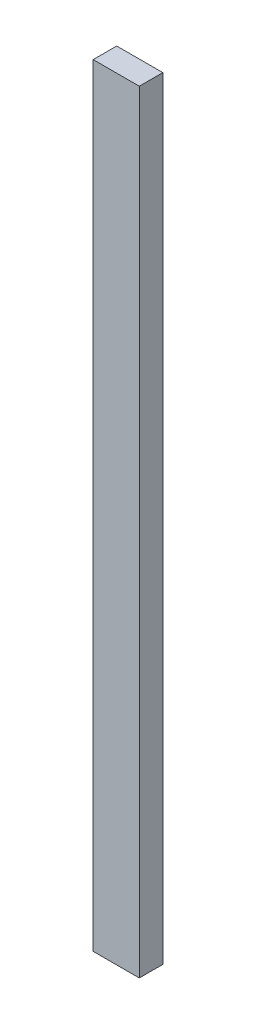
ISO-10303-21;
HEADER;
FILE_DESCRIPTION(('STEP AP214'),'2;1');
FILE_NAME('part.step','',(''),(''),'','','');
FILE_SCHEMA(('AUTOMOTIVE_DESIGN { 1 0 10303 214 1 1 1 1 }'));
ENDSEC;
DATA;
#1=APPLICATION_CONTEXT('core data for automotive mechanical design processes');
#2=APPLICATION_PROTOCOL_DEFINITION('international standard','automotive_design',2000,#1);
#3=PRODUCT_CONTEXT('',#1,'mechanical');
#4=PRODUCT('Part','Part','',(#3));
#5=PRODUCT_RELATED_PRODUCT_CATEGORY('part','',(#4));
#6=PRODUCT_DEFINITION_FORMATION('','',#4);
#7=PRODUCT_DEFINITION_CONTEXT('part definition',#1,'design');
#8=PRODUCT_DEFINITION('design','',#6,#7);
#9=PRODUCT_DEFINITION_SHAPE('','',#8);
#10=(LENGTH_UNIT() NAMED_UNIT(*) SI_UNIT(.MILLI.,.METRE.));
#11=(NAMED_UNIT(*) PLANE_ANGLE_UNIT() SI_UNIT($,.RADIAN.));
#12=(NAMED_UNIT(*) SI_UNIT($,.STERADIAN.) SOLID_ANGLE_UNIT());
#13=UNCERTAINTY_MEASURE_WITH_UNIT(LENGTH_MEASURE(1.E-05),#10,'distance_accuracy_value','');
#14=(GEOMETRIC_REPRESENTATION_CONTEXT(3) GLOBAL_UNCERTAINTY_ASSIGNED_CONTEXT((#13)) GLOBAL_UNIT_ASSIGNED_CONTEXT((#10,
#11,#12)) REPRESENTATION_CONTEXT('',''));
#15=CARTESIAN_POINT('',(0.,0.,0.));
#16=DIRECTION('',(0.,0.,1.));
#17=DIRECTION('',(1.,0.,0.));
#18=AXIS2_PLACEMENT_3D('',#15,#16,#17);
#19=CARTESIAN_POINT('',(-10.27,20.47,328.78));
#20=DIRECTION('',(0.,1.,0.));
#21=DIRECTION('',(0.,0.,1.));
#22=AXIS2_PLACEMENT_3D('',#19,#20,#21);
#23=PLANE('',#22);
#24=DIRECTION('',(1.,0.,0.));
#25=VECTOR('',#24,1.);
#26=CARTESIAN_POINT('',(301.625,20.47,-31.7500000000001));
#27=LINE('',#26,#25);
#28=CARTESIAN_POINT('',(261.525,20.47,-31.7500000000001));
#29=VERTEX_POINT('',#28);
#30=CARTESIAN_POINT('',(301.625,20.47,-31.7500000000001));
#31=VERTEX_POINT('',#30);
#32=EDGE_CURVE('E11',#29,#31,#27,.T.);
#33=ORIENTED_EDGE('',*,*,#32,.F.);
#34=DIRECTION('',(0.,0.,-1.));
#35=VECTOR('',#34,1.);
#36=CARTESIAN_POINT('',(261.525,20.47,-328.78));
#37=LINE('',#36,#35);
#38=CARTESIAN_POINT('',(261.525,20.47,-52.2200000000001));
#39=VERTEX_POINT('',#38);
#40=EDGE_CURVE('E37',#29,#39,#37,.T.);
#41=ORIENTED_EDGE('',*,*,#40,.T.);
#42=DIRECTION('',(-1.,0.,0.));
#43=VECTOR('',#42,1.);
#44=CARTESIAN_POINT('',(301.625,20.47,-52.22));
#45=LINE('',#44,#43);
#46=CARTESIAN_POINT('',(301.625,20.47,-52.22));
#47=VERTEX_POINT('',#46);
#48=EDGE_CURVE('E43',#47,#39,#45,.T.);
#49=ORIENTED_EDGE('',*,*,#48,.F.);
#50=DIRECTION('',(0.,0.,-1.));
#51=VECTOR('',#50,1.);
#52=CARTESIAN_POINT('',(301.625,20.47,349.25));
#53=LINE('',#52,#51);
#54=EDGE_CURVE('E77',#31,#47,#53,.T.);
#55=ORIENTED_EDGE('',*,*,#54,.F.);
#56=EDGE_LOOP('',(#33,#41,#49,#55));
#57=FACE_BOUND('',#56,.T.);
#58=ADVANCED_FACE('F34',(#57),#23,.F.);
#59=CARTESIAN_POINT('',(301.625,20.47,349.25));
#60=DIRECTION('',(-1.,0.,0.));
#61=DIRECTION('',(0.,0.,1.));
#62=AXIS2_PLACEMENT_3D('',#59,#60,#61);
#63=PLANE('',#62);
#64=DIRECTION('',(0.,-1.,0.));
#65=VECTOR('',#64,1.);
#66=CARTESIAN_POINT('',(301.625,692.15,-31.7500000000001));
#67=LINE('',#66,#65);
#68=CARTESIAN_POINT('',(301.625,692.15,-31.7500000000001));
#69=VERTEX_POINT('',#68);
#70=EDGE_CURVE('E97',#69,#31,#67,.T.);
#71=ORIENTED_EDGE('',*,*,#70,.T.);
#72=ORIENTED_EDGE('',*,*,#54,.T.);
#73=DIRECTION('',(0.,-1.,0.));
#74=VECTOR('',#73,1.);
#75=CARTESIAN_POINT('',(301.625,692.15,-52.22));
#76=LINE('',#75,#74);
#77=CARTESIAN_POINT('',(301.625,692.15,-52.22));
#78=VERTEX_POINT('',#77);
#79=EDGE_CURVE('E88',#78,#47,#76,.T.);
#80=ORIENTED_EDGE('',*,*,#79,.F.);
#81=DIRECTION('',(0.,0.,-1.));
#82=VECTOR('',#81,1.);
#83=CARTESIAN_POINT('',(301.625,692.15,-52.22));
#84=LINE('',#83,#82);
#85=EDGE_CURVE('E95',#69,#78,#84,.T.);
#86=ORIENTED_EDGE('',*,*,#85,.F.);
#87=EDGE_LOOP('',(#71,#72,#80,#86));
#88=FACE_BOUND('',#87,.T.);
#89=ADVANCED_FACE('F107',(#88),#63,.F.);
#90=CARTESIAN_POINT('',(0.,692.15,0.));
#91=DIRECTION('',(0.,-1.,0.));
#92=DIRECTION('',(0.,0.,-1.));
#93=AXIS2_PLACEMENT_3D('',#90,#91,#92);
#94=PLANE('',#93);
#95=DIRECTION('',(0.,0.,1.));
#96=VECTOR('',#95,1.);
#97=CARTESIAN_POINT('',(261.525,692.15,-52.2200000000001));
#98=LINE('',#97,#96);
#99=CARTESIAN_POINT('',(261.525,692.15,-52.2200000000001));
#100=VERTEX_POINT('',#99);
#101=CARTESIAN_POINT('',(261.525,692.15,-31.7500000000001));
#102=VERTEX_POINT('',#101);
#103=EDGE_CURVE('E90',#100,#102,#98,.T.);
#104=ORIENTED_EDGE('',*,*,#103,.T.);
#105=DIRECTION('',(1.,0.,0.));
#106=VECTOR('',#105,1.);
#107=CARTESIAN_POINT('',(301.625,692.15,-31.7500000000001));
#108=LINE('',#107,#106);
#109=EDGE_CURVE('E69',#102,#69,#108,.T.);
#110=ORIENTED_EDGE('',*,*,#109,.T.);
#111=ORIENTED_EDGE('',*,*,#85,.T.);
#112=DIRECTION('',(-1.,0.,0.));
#113=VECTOR('',#112,1.);
#114=CARTESIAN_POINT('',(301.625,692.15,-52.22));
#115=LINE('',#114,#113);
#116=EDGE_CURVE('E93',#78,#100,#115,.T.);
#117=ORIENTED_EDGE('',*,*,#116,.T.);
#118=EDGE_LOOP('',(#104,#110,#111,#117));
#119=FACE_BOUND('',#118,.T.);
#120=ADVANCED_FACE('F102',(#119),#94,.F.);
#121=CARTESIAN_POINT('',(261.525,20.47,-328.78));
#122=DIRECTION('',(-1.,0.,0.));
#123=DIRECTION('',(0.,0.,1.));
#124=AXIS2_PLACEMENT_3D('',#121,#122,#123);
#125=PLANE('',#124);
#126=ORIENTED_EDGE('',*,*,#40,.F.);
#127=DIRECTION('',(0.,-1.,0.));
#128=VECTOR('',#127,1.);
#129=CARTESIAN_POINT('',(261.525,692.15,-31.7500000000001));
#130=LINE('',#129,#128);
#131=EDGE_CURVE('E103',#102,#29,#130,.T.);
#132=ORIENTED_EDGE('',*,*,#131,.F.);
#133=ORIENTED_EDGE('',*,*,#103,.F.);
#134=DIRECTION('',(0.,-1.,0.));
#135=VECTOR('',#134,1.);
#136=CARTESIAN_POINT('',(261.525,692.15,-52.2200000000001));
#137=LINE('',#136,#135);
#138=EDGE_CURVE('E86',#100,#39,#137,.T.);
#139=ORIENTED_EDGE('',*,*,#138,.T.);
#140=EDGE_LOOP('',(#126,#132,#133,#139));
#141=FACE_BOUND('',#140,.T.);
#142=ADVANCED_FACE('F92',(#141),#125,.T.);
#143=CARTESIAN_POINT('',(301.625,692.15,-52.22));
#144=DIRECTION('',(0.,0.,1.));
#145=DIRECTION('',(1.,0.,0.));
#146=AXIS2_PLACEMENT_3D('',#143,#144,#145);
#147=PLANE('',#146);
#148=ORIENTED_EDGE('',*,*,#48,.T.);
#149=ORIENTED_EDGE('',*,*,#138,.F.);
#150=ORIENTED_EDGE('',*,*,#116,.F.);
#151=ORIENTED_EDGE('',*,*,#79,.T.);
#152=EDGE_LOOP('',(#148,#149,#150,#151));
#153=FACE_BOUND('',#152,.T.);
#154=ADVANCED_FACE('F84',(#153),#147,.F.);
#155=CARTESIAN_POINT('',(301.625,692.15,-31.7500000000001));
#156=DIRECTION('',(0.,0.,-1.));
#157=DIRECTION('',(-1.,0.,0.));
#158=AXIS2_PLACEMENT_3D('',#155,#156,#157);
#159=PLANE('',#158);
#160=ORIENTED_EDGE('',*,*,#32,.T.);
#161=ORIENTED_EDGE('',*,*,#70,.F.);
#162=ORIENTED_EDGE('',*,*,#109,.F.);
#163=ORIENTED_EDGE('',*,*,#131,.T.);
#164=EDGE_LOOP('',(#160,#161,#162,#163));
#165=FACE_BOUND('',#164,.T.);
#166=ADVANCED_FACE('F108',(#165),#159,.F.);
#167=CLOSED_SHELL('',(#58,#89,#120,#142,#154,#166));
#168=MANIFOLD_SOLID_BREP('B2',#167);
#169=ADVANCED_BREP_SHAPE_REPRESENTATION('',(#18,#168),#14);
#170=SHAPE_DEFINITION_REPRESENTATION(#9,#169);
ENDSEC;
END-ISO-10303-21;
